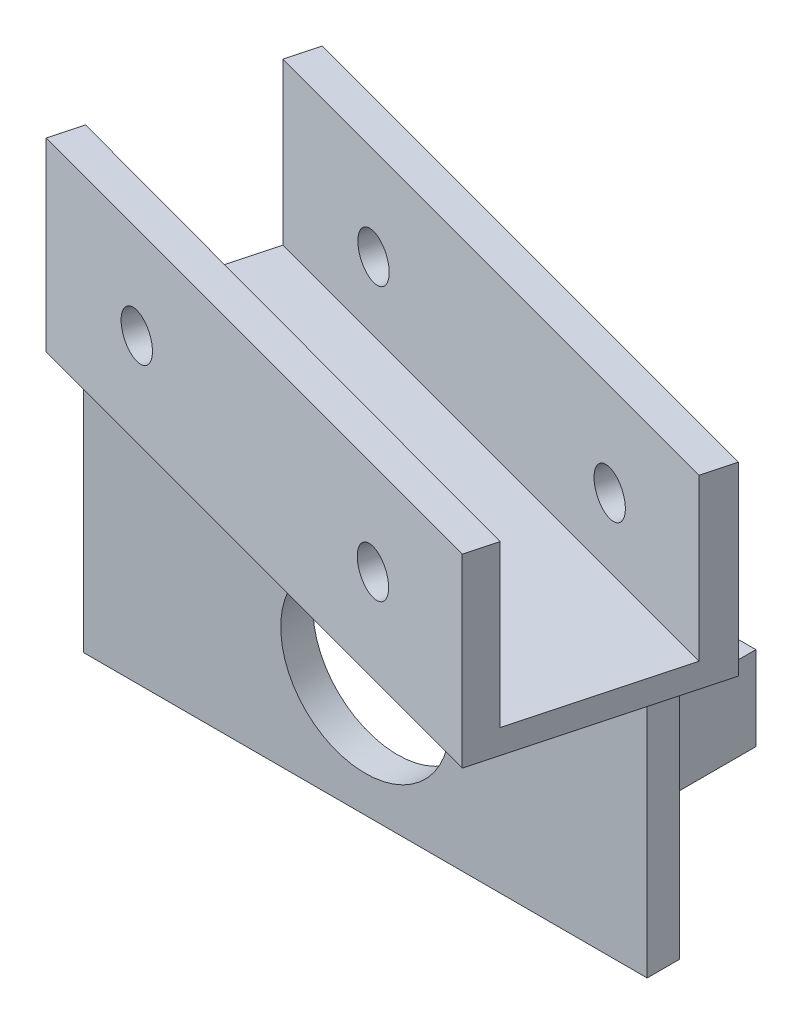
ISO-10303-21;
HEADER;
FILE_DESCRIPTION(('STEP AP214'),'2;1');
FILE_NAME('part.step','',(''),(''),'','','');
FILE_SCHEMA(('AUTOMOTIVE_DESIGN { 1 0 10303 214 1 1 1 1 }'));
ENDSEC;
DATA;
#1=APPLICATION_CONTEXT('core data for automotive mechanical design processes');
#2=APPLICATION_PROTOCOL_DEFINITION('international standard','automotive_design',2000,#1);
#3=PRODUCT_CONTEXT('',#1,'mechanical');
#4=PRODUCT('Part','Part','',(#3));
#5=PRODUCT_RELATED_PRODUCT_CATEGORY('part','',(#4));
#6=PRODUCT_DEFINITION_FORMATION('','',#4);
#7=PRODUCT_DEFINITION_CONTEXT('part definition',#1,'design');
#8=PRODUCT_DEFINITION('design','',#6,#7);
#9=PRODUCT_DEFINITION_SHAPE('','',#8);
#10=(LENGTH_UNIT() NAMED_UNIT(*) SI_UNIT(.MILLI.,.METRE.));
#11=(NAMED_UNIT(*) PLANE_ANGLE_UNIT() SI_UNIT($,.RADIAN.));
#12=(NAMED_UNIT(*) SI_UNIT($,.STERADIAN.) SOLID_ANGLE_UNIT());
#13=UNCERTAINTY_MEASURE_WITH_UNIT(LENGTH_MEASURE(1.E-05),#10,'distance_accuracy_value','');
#14=(GEOMETRIC_REPRESENTATION_CONTEXT(3) GLOBAL_UNCERTAINTY_ASSIGNED_CONTEXT((#13)) GLOBAL_UNIT_ASSIGNED_CONTEXT((#10,
#11,#12)) REPRESENTATION_CONTEXT('',''));
#15=CARTESIAN_POINT('',(0.,0.,0.));
#16=DIRECTION('',(0.,0.,1.));
#17=DIRECTION('',(1.,0.,0.));
#18=AXIS2_PLACEMENT_3D('',#15,#16,#17);
#19=CARTESIAN_POINT('',(0.,0.,0.));
#20=DIRECTION('',(0.,0.,1.));
#21=DIRECTION('',(1.,0.,0.));
#22=AXIS2_PLACEMENT_3D('',#19,#20,#21);
#23=PLANE('',#22);
#24=DIRECTION('',(0.,-1.,0.));
#25=VECTOR('',#24,1.);
#26=CARTESIAN_POINT('',(62.5000000000001,-8.93838300419958,0.));
#27=LINE('',#26,#25);
#28=CARTESIAN_POINT('',(62.5000000000001,-8.93838300419958,0.));
#29=VERTEX_POINT('',#28);
#30=CARTESIAN_POINT('',(62.5000000000001,-19.3737653444259,0.));
#31=VERTEX_POINT('',#30);
#32=EDGE_CURVE('E284',#29,#31,#27,.T.);
#33=ORIENTED_EDGE('',*,*,#32,.F.);
#34=DIRECTION('',(1.,0.,0.));
#35=VECTOR('',#34,1.);
#36=CARTESIAN_POINT('',(62.5000000000001,-8.93838300419958,0.));
#37=LINE('',#36,#35);
#38=CARTESIAN_POINT('',(54.3490123333825,-8.93838300419958,0.));
#39=VERTEX_POINT('',#38);
#40=EDGE_CURVE('E314',#39,#29,#37,.T.);
#41=ORIENTED_EDGE('',*,*,#40,.F.);
#42=DIRECTION('',(0.,1.,0.));
#43=VECTOR('',#42,1.);
#44=CARTESIAN_POINT('',(54.3490123333825,-8.93838300419958,0.));
#45=LINE('',#44,#43);
#46=CARTESIAN_POINT('',(54.3490123333825,-19.3737653444259,0.));
#47=VERTEX_POINT('',#46);
#48=EDGE_CURVE('E319',#47,#39,#45,.T.);
#49=ORIENTED_EDGE('',*,*,#48,.F.);
#50=DIRECTION('',(-1.,0.,0.));
#51=VECTOR('',#50,1.);
#52=CARTESIAN_POINT('',(54.3490123333825,-19.3737653444259,0.));
#53=LINE('',#52,#51);
#54=EDGE_CURVE('E325',#31,#47,#53,.T.);
#55=ORIENTED_EDGE('',*,*,#54,.F.);
#56=EDGE_LOOP('',(#33,#41,#49,#55));
#57=FACE_BOUND('',#56,.T.);
#58=DIRECTION('',(0.,-1.,0.));
#59=VECTOR('',#58,1.);
#60=CARTESIAN_POINT('',(0.,0.,0.));
#61=LINE('',#60,#59);
#62=CARTESIAN_POINT('',(0.,0.,0.));
#63=VERTEX_POINT('',#62);
#64=CARTESIAN_POINT('',(0.,-30.,0.));
#65=VERTEX_POINT('',#64);
#66=EDGE_CURVE('E340',#63,#65,#61,.T.);
#67=ORIENTED_EDGE('',*,*,#66,.F.);
#68=DIRECTION('',(-1.,0.,0.));
#69=VECTOR('',#68,1.);
#70=CARTESIAN_POINT('',(0.,0.,0.));
#71=LINE('',#70,#69);
#72=CARTESIAN_POINT('',(70.,0.,0.));
#73=VERTEX_POINT('',#72);
#74=EDGE_CURVE('E341',#73,#63,#71,.T.);
#75=ORIENTED_EDGE('',*,*,#74,.F.);
#76=DIRECTION('',(0.,1.,0.));
#77=VECTOR('',#76,1.);
#78=CARTESIAN_POINT('',(70.,0.,0.));
#79=LINE('',#78,#77);
#80=CARTESIAN_POINT('',(70.,-30.,0.));
#81=VERTEX_POINT('',#80);
#82=EDGE_CURVE('E354',#81,#73,#79,.T.);
#83=ORIENTED_EDGE('',*,*,#82,.F.);
#84=DIRECTION('',(1.,0.,0.));
#85=VECTOR('',#84,1.);
#86=CARTESIAN_POINT('',(0.,-30.,0.));
#87=LINE('',#86,#85);
#88=EDGE_CURVE('E352',#65,#81,#87,.T.);
#89=ORIENTED_EDGE('',*,*,#88,.F.);
#90=EDGE_LOOP('',(#67,#75,#83,#89));
#91=FACE_BOUND('',#90,.T.);
#92=CARTESIAN_POINT('',(35.,-15.,0.));
#93=DIRECTION('',(0.,0.,1.));
#94=DIRECTION('',(1.,0.,0.));
#95=AXIS2_PLACEMENT_3D('',#92,#93,#94);
#96=CIRCLE('',#95,10.5);
#97=CARTESIAN_POINT('',(45.5,-15.,0.));
#98=VERTEX_POINT('',#97);
#99=EDGE_CURVE('E305',#98,#98,#96,.T.);
#100=ORIENTED_EDGE('',*,*,#99,.T.);
#101=EDGE_LOOP('',(#100));
#102=FACE_BOUND('',#101,.T.);
#103=DIRECTION('',(0.,1.,0.));
#104=VECTOR('',#103,1.);
#105=CARTESIAN_POINT('',(7.50000000000006,-25.,0.));
#106=LINE('',#105,#104);
#107=CARTESIAN_POINT('',(7.50000000000006,-25.,0.));
#108=VERTEX_POINT('',#107);
#109=CARTESIAN_POINT('',(7.50000000000006,-5.00000000000002,0.));
#110=VERTEX_POINT('',#109);
#111=EDGE_CURVE('E276',#108,#110,#106,.T.);
#112=ORIENTED_EDGE('',*,*,#111,.F.);
#113=DIRECTION('',(-1.,0.,0.));
#114=VECTOR('',#113,1.);
#115=CARTESIAN_POINT('',(14.3209161154327,-25.,0.));
#116=LINE('',#115,#114);
#117=CARTESIAN_POINT('',(14.3209161154327,-25.,0.));
#118=VERTEX_POINT('',#117);
#119=EDGE_CURVE('E275',#118,#108,#116,.T.);
#120=ORIENTED_EDGE('',*,*,#119,.F.);
#121=DIRECTION('',(0.,-1.,0.));
#122=VECTOR('',#121,1.);
#123=CARTESIAN_POINT('',(14.3209161154327,-5.00000000000002,0.));
#124=LINE('',#123,#122);
#125=CARTESIAN_POINT('',(14.3209161154327,-5.00000000000002,0.));
#126=VERTEX_POINT('',#125);
#127=EDGE_CURVE('E286',#126,#118,#124,.T.);
#128=ORIENTED_EDGE('',*,*,#127,.F.);
#129=DIRECTION('',(1.,0.,0.));
#130=VECTOR('',#129,1.);
#131=CARTESIAN_POINT('',(7.50000000000006,-5.00000000000002,0.));
#132=LINE('',#131,#130);
#133=EDGE_CURVE('E282',#110,#126,#132,.T.);
#134=ORIENTED_EDGE('',*,*,#133,.F.);
#135=EDGE_LOOP('',(#112,#120,#128,#134));
#136=FACE_BOUND('',#135,.T.);
#137=ADVANCED_FACE('F39',(#57,#91,#102,#136),#23,.F.);
#138=CARTESIAN_POINT('',(0.,0.,4.));
#139=DIRECTION('',(0.,0.,1.));
#140=DIRECTION('',(1.,0.,0.));
#141=AXIS2_PLACEMENT_3D('',#138,#139,#140);
#142=PLANE('',#141);
#143=DIRECTION('',(0.,-1.,0.));
#144=VECTOR('',#143,1.);
#145=CARTESIAN_POINT('',(0.,0.,4.));
#146=LINE('',#145,#144);
#147=CARTESIAN_POINT('',(0.,0.,4.));
#148=VERTEX_POINT('',#147);
#149=CARTESIAN_POINT('',(0.,-30.,4.));
#150=VERTEX_POINT('',#149);
#151=EDGE_CURVE('E338',#148,#150,#146,.T.);
#152=ORIENTED_EDGE('',*,*,#151,.T.);
#153=DIRECTION('',(1.,0.,0.));
#154=VECTOR('',#153,1.);
#155=CARTESIAN_POINT('',(0.,-30.,4.));
#156=LINE('',#155,#154);
#157=CARTESIAN_POINT('',(70.,-30.,4.));
#158=VERTEX_POINT('',#157);
#159=EDGE_CURVE('E344',#150,#158,#156,.T.);
#160=ORIENTED_EDGE('',*,*,#159,.T.);
#161=DIRECTION('',(0.,1.,0.));
#162=VECTOR('',#161,1.);
#163=CARTESIAN_POINT('',(70.,0.,4.));
#164=LINE('',#163,#162);
#165=CARTESIAN_POINT('',(70.,0.,4.));
#166=VERTEX_POINT('',#165);
#167=EDGE_CURVE('E346',#158,#166,#164,.T.);
#168=ORIENTED_EDGE('',*,*,#167,.T.);
#169=DIRECTION('',(-1.,0.,0.));
#170=VECTOR('',#169,1.);
#171=CARTESIAN_POINT('',(0.,0.,4.));
#172=LINE('',#171,#170);
#173=EDGE_CURVE('E349',#166,#148,#172,.T.);
#174=ORIENTED_EDGE('',*,*,#173,.T.);
#175=EDGE_LOOP('',(#152,#160,#168,#174));
#176=FACE_BOUND('',#175,.T.);
#177=CARTESIAN_POINT('',(35.,-15.,4.));
#178=DIRECTION('',(0.,0.,1.));
#179=DIRECTION('',(1.,0.,0.));
#180=AXIS2_PLACEMENT_3D('',#177,#178,#179);
#181=CIRCLE('',#180,10.5);
#182=CARTESIAN_POINT('',(45.5,-15.,4.));
#183=VERTEX_POINT('',#182);
#184=EDGE_CURVE('E333',#183,#183,#181,.T.);
#185=ORIENTED_EDGE('',*,*,#184,.F.);
#186=EDGE_LOOP('',(#185));
#187=FACE_BOUND('',#186,.T.);
#188=ADVANCED_FACE('F418',(#176,#187),#142,.T.);
#189=CARTESIAN_POINT('',(0.,0.,4.));
#190=DIRECTION('',(1.,0.,0.));
#191=DIRECTION('',(0.,1.,0.));
#192=AXIS2_PLACEMENT_3D('',#189,#190,#191);
#193=PLANE('',#192);
#194=ORIENTED_EDGE('',*,*,#66,.T.);
#195=DIRECTION('',(0.,0.,-1.));
#196=VECTOR('',#195,1.);
#197=CARTESIAN_POINT('',(0.,-30.,4.));
#198=LINE('',#197,#196);
#199=EDGE_CURVE('E11',#150,#65,#198,.T.);
#200=ORIENTED_EDGE('',*,*,#199,.F.);
#201=ORIENTED_EDGE('',*,*,#151,.F.);
#202=DIRECTION('',(0.,0.,-1.));
#203=VECTOR('',#202,1.);
#204=CARTESIAN_POINT('',(0.,0.,4.));
#205=LINE('',#204,#203);
#206=EDGE_CURVE('E350',#148,#63,#205,.T.);
#207=ORIENTED_EDGE('',*,*,#206,.T.);
#208=EDGE_LOOP('',(#194,#200,#201,#207));
#209=FACE_BOUND('',#208,.T.);
#210=ADVANCED_FACE('F41',(#209),#193,.F.);
#211=CARTESIAN_POINT('',(0.,-30.,4.));
#212=DIRECTION('',(0.,1.,0.));
#213=DIRECTION('',(0.,0.,1.));
#214=AXIS2_PLACEMENT_3D('',#211,#212,#213);
#215=PLANE('',#214);
#216=ORIENTED_EDGE('',*,*,#88,.T.);
#217=DIRECTION('',(0.,0.,-1.));
#218=VECTOR('',#217,1.);
#219=CARTESIAN_POINT('',(70.,-30.,4.));
#220=LINE('',#219,#218);
#221=EDGE_CURVE('E48',#158,#81,#220,.T.);
#222=ORIENTED_EDGE('',*,*,#221,.F.);
#223=ORIENTED_EDGE('',*,*,#159,.F.);
#224=ORIENTED_EDGE('',*,*,#199,.T.);
#225=EDGE_LOOP('',(#216,#222,#223,#224));
#226=FACE_BOUND('',#225,.T.);
#227=ADVANCED_FACE('F432',(#226),#215,.F.);
#228=CARTESIAN_POINT('',(70.,0.,4.));
#229=DIRECTION('',(-1.,0.,0.));
#230=DIRECTION('',(0.,0.,1.));
#231=AXIS2_PLACEMENT_3D('',#228,#229,#230);
#232=PLANE('',#231);
#233=ORIENTED_EDGE('',*,*,#82,.T.);
#234=DIRECTION('',(0.,0.,-1.));
#235=VECTOR('',#234,1.);
#236=CARTESIAN_POINT('',(70.,0.,4.));
#237=LINE('',#236,#235);
#238=EDGE_CURVE('E363',#166,#73,#237,.T.);
#239=ORIENTED_EDGE('',*,*,#238,.F.);
#240=ORIENTED_EDGE('',*,*,#167,.F.);
#241=ORIENTED_EDGE('',*,*,#221,.T.);
#242=EDGE_LOOP('',(#233,#239,#240,#241));
#243=FACE_BOUND('',#242,.T.);
#244=ADVANCED_FACE('F431',(#243),#232,.F.);
#245=CARTESIAN_POINT('',(35.,-15.,4.));
#246=DIRECTION('',(0.,0.,-1.));
#247=DIRECTION('',(-1.,0.,0.));
#248=AXIS2_PLACEMENT_3D('',#245,#246,#247);
#249=CYLINDRICAL_SURFACE('',#248,10.5);
#250=ORIENTED_EDGE('',*,*,#184,.T.);
#251=EDGE_LOOP('',(#250));
#252=FACE_BOUND('',#251,.T.);
#253=ORIENTED_EDGE('',*,*,#99,.F.);
#254=EDGE_LOOP('',(#253));
#255=FACE_BOUND('',#254,.T.);
#256=ADVANCED_FACE('F433',(#252,#255),#249,.F.);
#257=CARTESIAN_POINT('',(62.5000000000001,-8.93838300419958,-17.));
#258=DIRECTION('',(-1.,0.,0.));
#259=DIRECTION('',(0.,0.,1.));
#260=AXIS2_PLACEMENT_3D('',#257,#258,#259);
#261=PLANE('',#260);
#262=ORIENTED_EDGE('',*,*,#32,.T.);
#263=DIRECTION('',(0.,0.,1.));
#264=VECTOR('',#263,1.);
#265=CARTESIAN_POINT('',(62.5000000000001,-19.3737653444259,-17.));
#266=LINE('',#265,#264);
#267=CARTESIAN_POINT('',(62.5000000000001,-19.3737653444259,-17.));
#268=VERTEX_POINT('',#267);
#269=EDGE_CURVE('E254',#268,#31,#266,.T.);
#270=ORIENTED_EDGE('',*,*,#269,.F.);
#271=DIRECTION('',(0.,-1.,0.));
#272=VECTOR('',#271,1.);
#273=CARTESIAN_POINT('',(62.5000000000001,-8.93838300419958,-17.));
#274=LINE('',#273,#272);
#275=CARTESIAN_POINT('',(62.5000000000001,-8.93838300419958,-17.));
#276=VERTEX_POINT('',#275);
#277=EDGE_CURVE('E316',#276,#268,#274,.T.);
#278=ORIENTED_EDGE('',*,*,#277,.F.);
#279=DIRECTION('',(0.,0.,1.));
#280=VECTOR('',#279,1.);
#281=CARTESIAN_POINT('',(62.5000000000001,-8.93838300419958,-17.));
#282=LINE('',#281,#280);
#283=EDGE_CURVE('E311',#276,#29,#282,.T.);
#284=ORIENTED_EDGE('',*,*,#283,.T.);
#285=EDGE_LOOP('',(#262,#270,#278,#284));
#286=FACE_BOUND('',#285,.T.);
#287=ADVANCED_FACE('F458',(#286),#261,.F.);
#288=CARTESIAN_POINT('',(54.3490123333825,-19.3737653444259,-17.));
#289=DIRECTION('',(0.,1.,0.));
#290=DIRECTION('',(0.,0.,1.));
#291=AXIS2_PLACEMENT_3D('',#288,#289,#290);
#292=PLANE('',#291);
#293=ORIENTED_EDGE('',*,*,#54,.T.);
#294=DIRECTION('',(0.,0.,1.));
#295=VECTOR('',#294,1.);
#296=CARTESIAN_POINT('',(54.3490123333825,-19.3737653444259,-17.));
#297=LINE('',#296,#295);
#298=CARTESIAN_POINT('',(54.3490123333825,-19.3737653444259,-17.));
#299=VERTEX_POINT('',#298);
#300=EDGE_CURVE('E304',#299,#47,#297,.T.);
#301=ORIENTED_EDGE('',*,*,#300,.F.);
#302=DIRECTION('',(-1.,0.,0.));
#303=VECTOR('',#302,1.);
#304=CARTESIAN_POINT('',(54.3490123333825,-19.3737653444259,-17.));
#305=LINE('',#304,#303);
#306=EDGE_CURVE('E330',#268,#299,#305,.T.);
#307=ORIENTED_EDGE('',*,*,#306,.F.);
#308=ORIENTED_EDGE('',*,*,#269,.T.);
#309=EDGE_LOOP('',(#293,#301,#307,#308));
#310=FACE_BOUND('',#309,.T.);
#311=ADVANCED_FACE('F495',(#310),#292,.F.);
#312=CARTESIAN_POINT('',(54.3490123333825,-8.93838300419958,-17.));
#313=DIRECTION('',(1.,0.,0.));
#314=DIRECTION('',(0.,0.,-1.));
#315=AXIS2_PLACEMENT_3D('',#312,#313,#314);
#316=PLANE('',#315);
#317=ORIENTED_EDGE('',*,*,#48,.T.);
#318=DIRECTION('',(0.,0.,1.));
#319=VECTOR('',#318,1.);
#320=CARTESIAN_POINT('',(54.3490123333825,-8.93838300419958,-17.));
#321=LINE('',#320,#319);
#322=CARTESIAN_POINT('',(54.3490123333825,-8.93838300419958,-17.));
#323=VERTEX_POINT('',#322);
#324=EDGE_CURVE('E308',#323,#39,#321,.T.);
#325=ORIENTED_EDGE('',*,*,#324,.F.);
#326=DIRECTION('',(0.,1.,0.));
#327=VECTOR('',#326,1.);
#328=CARTESIAN_POINT('',(54.3490123333825,-8.93838300419958,-17.));
#329=LINE('',#328,#327);
#330=EDGE_CURVE('E329',#299,#323,#329,.T.);
#331=ORIENTED_EDGE('',*,*,#330,.F.);
#332=ORIENTED_EDGE('',*,*,#300,.T.);
#333=EDGE_LOOP('',(#317,#325,#331,#332));
#334=FACE_BOUND('',#333,.T.);
#335=ADVANCED_FACE('F496',(#334),#316,.F.);
#336=CARTESIAN_POINT('',(62.5000000000001,-8.93838300419958,-17.));
#337=DIRECTION('',(0.,-1.,0.));
#338=DIRECTION('',(0.,0.,-1.));
#339=AXIS2_PLACEMENT_3D('',#336,#337,#338);
#340=PLANE('',#339);
#341=ORIENTED_EDGE('',*,*,#40,.T.);
#342=ORIENTED_EDGE('',*,*,#283,.F.);
#343=DIRECTION('',(1.,0.,0.));
#344=VECTOR('',#343,1.);
#345=CARTESIAN_POINT('',(62.5000000000001,-8.93838300419958,-17.));
#346=LINE('',#345,#344);
#347=EDGE_CURVE('E313',#323,#276,#346,.T.);
#348=ORIENTED_EDGE('',*,*,#347,.F.);
#349=ORIENTED_EDGE('',*,*,#324,.T.);
#350=EDGE_LOOP('',(#341,#342,#348,#349));
#351=FACE_BOUND('',#350,.T.);
#352=ADVANCED_FACE('F499',(#351),#340,.F.);
#353=CARTESIAN_POINT('',(0.,0.,-17.));
#354=DIRECTION('',(0.,0.,1.));
#355=DIRECTION('',(1.,0.,0.));
#356=AXIS2_PLACEMENT_3D('',#353,#354,#355);
#357=PLANE('',#356);
#358=CARTESIAN_POINT('',(58.5000000000001,-14.2890995260664,-17.));
#359=DIRECTION('',(0.,0.,-1.));
#360=DIRECTION('',(-1.,0.,0.));
#361=AXIS2_PLACEMENT_3D('',#358,#359,#360);
#362=CIRCLE('',#361,0.999999999999998);
#363=CARTESIAN_POINT('',(57.5000000000001,-14.2890995260664,-17.));
#364=VERTEX_POINT('',#363);
#365=EDGE_CURVE('E251',#364,#364,#362,.T.);
#366=ORIENTED_EDGE('',*,*,#365,.F.);
#367=EDGE_LOOP('',(#366));
#368=FACE_BOUND('',#367,.T.);
#369=ORIENTED_EDGE('',*,*,#277,.T.);
#370=ORIENTED_EDGE('',*,*,#306,.T.);
#371=ORIENTED_EDGE('',*,*,#330,.T.);
#372=ORIENTED_EDGE('',*,*,#347,.T.);
#373=EDGE_LOOP('',(#369,#370,#371,#372));
#374=FACE_BOUND('',#373,.T.);
#375=ADVANCED_FACE('F488',(#368,#374),#357,.F.);
#376=CARTESIAN_POINT('',(7.50000000000006,-25.,-17.));
#377=DIRECTION('',(1.,0.,0.));
#378=DIRECTION('',(0.,0.,-1.));
#379=AXIS2_PLACEMENT_3D('',#376,#377,#378);
#380=PLANE('',#379);
#381=ORIENTED_EDGE('',*,*,#111,.T.);
#382=DIRECTION('',(0.,0.,1.));
#383=VECTOR('',#382,1.);
#384=CARTESIAN_POINT('',(7.50000000000006,-5.00000000000002,-17.));
#385=LINE('',#384,#383);
#386=CARTESIAN_POINT('',(7.50000000000006,-5.00000000000002,-17.));
#387=VERTEX_POINT('',#386);
#388=EDGE_CURVE('E299',#387,#110,#385,.T.);
#389=ORIENTED_EDGE('',*,*,#388,.F.);
#390=DIRECTION('',(0.,1.,0.));
#391=VECTOR('',#390,1.);
#392=CARTESIAN_POINT('',(7.50000000000006,-25.,-17.));
#393=LINE('',#392,#391);
#394=CARTESIAN_POINT('',(7.50000000000006,-25.,-17.));
#395=VERTEX_POINT('',#394);
#396=EDGE_CURVE('E267',#395,#387,#393,.T.);
#397=ORIENTED_EDGE('',*,*,#396,.F.);
#398=DIRECTION('',(0.,0.,1.));
#399=VECTOR('',#398,1.);
#400=CARTESIAN_POINT('',(7.50000000000006,-25.,-17.));
#401=LINE('',#400,#399);
#402=EDGE_CURVE('E279',#395,#108,#401,.T.);
#403=ORIENTED_EDGE('',*,*,#402,.T.);
#404=EDGE_LOOP('',(#381,#389,#397,#403));
#405=FACE_BOUND('',#404,.T.);
#406=ADVANCED_FACE('F468',(#405),#380,.F.);
#407=CARTESIAN_POINT('',(7.50000000000006,-5.00000000000002,-17.));
#408=DIRECTION('',(0.,-1.,0.));
#409=DIRECTION('',(0.,0.,-1.));
#410=AXIS2_PLACEMENT_3D('',#407,#408,#409);
#411=PLANE('',#410);
#412=ORIENTED_EDGE('',*,*,#133,.T.);
#413=DIRECTION('',(0.,0.,1.));
#414=VECTOR('',#413,1.);
#415=CARTESIAN_POINT('',(14.3209161154327,-5.00000000000002,-17.));
#416=LINE('',#415,#414);
#417=CARTESIAN_POINT('',(14.3209161154327,-5.00000000000002,-17.));
#418=VERTEX_POINT('',#417);
#419=EDGE_CURVE('E298',#418,#126,#416,.T.);
#420=ORIENTED_EDGE('',*,*,#419,.F.);
#421=DIRECTION('',(1.,0.,0.));
#422=VECTOR('',#421,1.);
#423=CARTESIAN_POINT('',(7.50000000000006,-5.00000000000002,-17.));
#424=LINE('',#423,#422);
#425=EDGE_CURVE('E272',#387,#418,#424,.T.);
#426=ORIENTED_EDGE('',*,*,#425,.F.);
#427=ORIENTED_EDGE('',*,*,#388,.T.);
#428=EDGE_LOOP('',(#412,#420,#426,#427));
#429=FACE_BOUND('',#428,.T.);
#430=ADVANCED_FACE('F479',(#429),#411,.F.);
#431=CARTESIAN_POINT('',(14.3209161154327,-5.00000000000002,-17.));
#432=DIRECTION('',(-1.,0.,0.));
#433=DIRECTION('',(0.,-1.,0.));
#434=AXIS2_PLACEMENT_3D('',#431,#432,#433);
#435=PLANE('',#434);
#436=ORIENTED_EDGE('',*,*,#127,.T.);
#437=DIRECTION('',(0.,0.,1.));
#438=VECTOR('',#437,1.);
#439=CARTESIAN_POINT('',(14.3209161154327,-25.,-17.));
#440=LINE('',#439,#438);
#441=CARTESIAN_POINT('',(14.3209161154327,-25.,-17.));
#442=VERTEX_POINT('',#441);
#443=EDGE_CURVE('E291',#442,#118,#440,.T.);
#444=ORIENTED_EDGE('',*,*,#443,.F.);
#445=DIRECTION('',(0.,-1.,0.));
#446=VECTOR('',#445,1.);
#447=CARTESIAN_POINT('',(14.3209161154327,-5.00000000000002,-17.));
#448=LINE('',#447,#446);
#449=EDGE_CURVE('E274',#418,#442,#448,.T.);
#450=ORIENTED_EDGE('',*,*,#449,.F.);
#451=ORIENTED_EDGE('',*,*,#419,.T.);
#452=EDGE_LOOP('',(#436,#444,#450,#451));
#453=FACE_BOUND('',#452,.T.);
#454=ADVANCED_FACE('F476',(#453),#435,.F.);
#455=CARTESIAN_POINT('',(14.3209161154327,-25.,-17.));
#456=DIRECTION('',(0.,1.,0.));
#457=DIRECTION('',(0.,0.,1.));
#458=AXIS2_PLACEMENT_3D('',#455,#456,#457);
#459=PLANE('',#458);
#460=ORIENTED_EDGE('',*,*,#119,.T.);
#461=ORIENTED_EDGE('',*,*,#402,.F.);
#462=DIRECTION('',(-1.,0.,0.));
#463=VECTOR('',#462,1.);
#464=CARTESIAN_POINT('',(14.3209161154327,-25.,-17.));
#465=LINE('',#464,#463);
#466=EDGE_CURVE('E277',#442,#395,#465,.T.);
#467=ORIENTED_EDGE('',*,*,#466,.F.);
#468=ORIENTED_EDGE('',*,*,#443,.T.);
#469=EDGE_LOOP('',(#460,#461,#467,#468));
#470=FACE_BOUND('',#469,.T.);
#471=ADVANCED_FACE('F467',(#470),#459,.F.);
#472=CARTESIAN_POINT('',(0.,0.,-17.));
#473=DIRECTION('',(0.,0.,-1.));
#474=DIRECTION('',(-1.,0.,0.));
#475=AXIS2_PLACEMENT_3D('',#472,#473,#474);
#476=PLANE('',#475);
#477=CARTESIAN_POINT('',(11.5000000000001,-7.00000000000002,-17.));
#478=DIRECTION('',(0.,0.,-1.));
#479=DIRECTION('',(-1.,0.,0.));
#480=AXIS2_PLACEMENT_3D('',#477,#478,#479);
#481=CIRCLE('',#480,1.);
#482=CARTESIAN_POINT('',(10.5000000000001,-7.00000000000002,-17.));
#483=VERTEX_POINT('',#482);
#484=EDGE_CURVE('E260',#483,#483,#481,.T.);
#485=ORIENTED_EDGE('',*,*,#484,.F.);
#486=EDGE_LOOP('',(#485));
#487=FACE_BOUND('',#486,.T.);
#488=CARTESIAN_POINT('',(11.5000000000001,-23.,-17.));
#489=DIRECTION('',(0.,0.,-1.));
#490=DIRECTION('',(-1.,0.,0.));
#491=AXIS2_PLACEMENT_3D('',#488,#489,#490);
#492=CIRCLE('',#491,1.);
#493=CARTESIAN_POINT('',(10.5000000000001,-23.,-17.));
#494=VERTEX_POINT('',#493);
#495=EDGE_CURVE('E264',#494,#494,#492,.T.);
#496=ORIENTED_EDGE('',*,*,#495,.F.);
#497=EDGE_LOOP('',(#496));
#498=FACE_BOUND('',#497,.T.);
#499=ORIENTED_EDGE('',*,*,#396,.T.);
#500=ORIENTED_EDGE('',*,*,#425,.T.);
#501=ORIENTED_EDGE('',*,*,#449,.T.);
#502=ORIENTED_EDGE('',*,*,#466,.T.);
#503=EDGE_LOOP('',(#499,#500,#501,#502));
#504=FACE_BOUND('',#503,.T.);
#505=ADVANCED_FACE('F475',(#487,#498,#504),#476,.T.);
#506=CARTESIAN_POINT('',(11.5000000000001,-23.,0.));
#507=DIRECTION('',(0.,0.,-1.));
#508=DIRECTION('',(-1.,0.,0.));
#509=AXIS2_PLACEMENT_3D('',#506,#507,#508);
#510=CYLINDRICAL_SURFACE('',#509,1.);
#511=CARTESIAN_POINT('',(11.5000000000001,-23.,0.));
#512=DIRECTION('',(0.,0.,-1.));
#513=DIRECTION('',(-1.,0.,0.));
#514=AXIS2_PLACEMENT_3D('',#511,#512,#513);
#515=CIRCLE('',#514,1.);
#516=CARTESIAN_POINT('',(10.5000000000001,-23.,0.));
#517=VERTEX_POINT('',#516);
#518=EDGE_CURVE('E189',#517,#517,#515,.T.);
#519=ORIENTED_EDGE('',*,*,#518,.F.);
#520=EDGE_LOOP('',(#519));
#521=FACE_BOUND('',#520,.T.);
#522=ORIENTED_EDGE('',*,*,#495,.T.);
#523=EDGE_LOOP('',(#522));
#524=FACE_BOUND('',#523,.T.);
#525=ADVANCED_FACE('F542',(#521,#524),#510,.F.);
#526=CARTESIAN_POINT('',(11.5000000000001,-23.,0.));
#527=DIRECTION('',(0.,0.,-1.));
#528=DIRECTION('',(-1.,0.,0.));
#529=AXIS2_PLACEMENT_3D('',#526,#527,#528);
#530=PLANE('',#529);
#531=ORIENTED_EDGE('',*,*,#518,.T.);
#532=EDGE_LOOP('',(#531));
#533=FACE_BOUND('',#532,.T.);
#534=ADVANCED_FACE('F536',(#533),#530,.T.);
#535=CARTESIAN_POINT('',(11.5000000000001,-7.00000000000002,0.));
#536=DIRECTION('',(0.,0.,-1.));
#537=DIRECTION('',(-1.,0.,0.));
#538=AXIS2_PLACEMENT_3D('',#535,#536,#537);
#539=CYLINDRICAL_SURFACE('',#538,1.);
#540=CARTESIAN_POINT('',(11.5000000000001,-7.00000000000002,0.));
#541=DIRECTION('',(0.,0.,-1.));
#542=DIRECTION('',(-1.,0.,0.));
#543=AXIS2_PLACEMENT_3D('',#540,#541,#542);
#544=CIRCLE('',#543,1.);
#545=CARTESIAN_POINT('',(10.5000000000001,-7.00000000000002,0.));
#546=VERTEX_POINT('',#545);
#547=EDGE_CURVE('E258',#546,#546,#544,.T.);
#548=ORIENTED_EDGE('',*,*,#547,.F.);
#549=EDGE_LOOP('',(#548));
#550=FACE_BOUND('',#549,.T.);
#551=ORIENTED_EDGE('',*,*,#484,.T.);
#552=EDGE_LOOP('',(#551));
#553=FACE_BOUND('',#552,.T.);
#554=ADVANCED_FACE('F535',(#550,#553),#539,.F.);
#555=CARTESIAN_POINT('',(11.5000000000001,-7.00000000000002,0.));
#556=DIRECTION('',(0.,0.,-1.));
#557=DIRECTION('',(-1.,0.,0.));
#558=AXIS2_PLACEMENT_3D('',#555,#556,#557);
#559=PLANE('',#558);
#560=ORIENTED_EDGE('',*,*,#547,.T.);
#561=EDGE_LOOP('',(#560));
#562=FACE_BOUND('',#561,.T.);
#563=ADVANCED_FACE('F523',(#562),#559,.T.);
#564=CARTESIAN_POINT('',(58.5000000000001,-14.2890995260664,0.));
#565=DIRECTION('',(0.,0.,-1.));
#566=DIRECTION('',(-1.,0.,0.));
#567=AXIS2_PLACEMENT_3D('',#564,#565,#566);
#568=CYLINDRICAL_SURFACE('',#567,0.999999999999998);
#569=CARTESIAN_POINT('',(58.5000000000001,-14.2890995260664,0.));
#570=DIRECTION('',(0.,0.,-1.));
#571=DIRECTION('',(-1.,0.,0.));
#572=AXIS2_PLACEMENT_3D('',#569,#570,#571);
#573=CIRCLE('',#572,0.999999999999998);
#574=CARTESIAN_POINT('',(57.5000000000001,-14.2890995260664,0.));
#575=VERTEX_POINT('',#574);
#576=EDGE_CURVE('E249',#575,#575,#573,.T.);
#577=ORIENTED_EDGE('',*,*,#576,.F.);
#578=EDGE_LOOP('',(#577));
#579=FACE_BOUND('',#578,.T.);
#580=ORIENTED_EDGE('',*,*,#365,.T.);
#581=EDGE_LOOP('',(#580));
#582=FACE_BOUND('',#581,.T.);
#583=ADVANCED_FACE('F521',(#579,#582),#568,.F.);
#584=CARTESIAN_POINT('',(58.5000000000001,-14.2890995260664,0.));
#585=DIRECTION('',(0.,0.,-1.));
#586=DIRECTION('',(-1.,0.,0.));
#587=AXIS2_PLACEMENT_3D('',#584,#585,#586);
#588=PLANE('',#587);
#589=ORIENTED_EDGE('',*,*,#576,.T.);
#590=EDGE_LOOP('',(#589));
#591=FACE_BOUND('',#590,.T.);
#592=ADVANCED_FACE('F524',(#591),#588,.T.);
#593=CARTESIAN_POINT('',(0.,0.,0.));
#594=DIRECTION('',(0.,1.,0.));
#595=DIRECTION('',(0.,0.,1.));
#596=AXIS2_PLACEMENT_3D('',#593,#594,#595);
#597=PLANE('',#596);
#598=DIRECTION('',(-0.258819045102515,0.,0.96592582628907));
#599=VECTOR('',#598,1.);
#600=CARTESIAN_POINT('',(-4.63036875734262,0.,4.));
#601=LINE('',#600,#599);
#602=CARTESIAN_POINT('',(2.61656450552779,0.,-23.0459231360939));
#603=VERTEX_POINT('',#602);
#604=CARTESIAN_POINT('',(-4.63036875734262,0.,4.));
#605=VERTEX_POINT('',#604);
#606=EDGE_CURVE('E187',#603,#605,#601,.T.);
#607=ORIENTED_EDGE('',*,*,#606,.F.);
#608=DIRECTION('',(-0.96592582628907,0.,-0.258819045102514));
#609=VECTOR('',#608,1.);
#610=CARTESIAN_POINT('',(73.1977220456754,0.,-4.13375897235806));
#611=LINE('',#610,#609);
#612=CARTESIAN_POINT('',(73.1977220456754,0.,-4.13375897235806));
#613=VERTEX_POINT('',#612);
#614=EDGE_CURVE('E236',#613,#603,#611,.T.);
#615=ORIENTED_EDGE('',*,*,#614,.F.);
#616=DIRECTION('',(0.258819045102514,0.,-0.96592582628907));
#617=VECTOR('',#616,1.);
#618=CARTESIAN_POINT('',(65.950788782805,0.,22.9121641637359));
#619=LINE('',#618,#617);
#620=CARTESIAN_POINT('',(65.950788782805,0.,22.9121641637359));
#621=VERTEX_POINT('',#620);
#622=EDGE_CURVE('E245',#621,#613,#619,.T.);
#623=ORIENTED_EDGE('',*,*,#622,.F.);
#624=DIRECTION('',(0.96592582628907,0.,0.258819045102514));
#625=VECTOR('',#624,1.);
#626=CARTESIAN_POINT('',(-4.63036875734262,0.,4.));
#627=LINE('',#626,#625);
#628=EDGE_CURVE('E239',#605,#621,#627,.T.);
#629=ORIENTED_EDGE('',*,*,#628,.F.);
#630=EDGE_LOOP('',(#607,#615,#623,#629));
#631=FACE_BOUND('',#630,.T.);
#632=ORIENTED_EDGE('',*,*,#238,.T.);
#633=ORIENTED_EDGE('',*,*,#74,.T.);
#634=ORIENTED_EDGE('',*,*,#206,.F.);
#635=ORIENTED_EDGE('',*,*,#173,.F.);
#636=EDGE_LOOP('',(#632,#633,#634,#635));
#637=FACE_BOUND('',#636,.T.);
#638=ADVANCED_FACE('F455',(#631,#637),#597,.F.);
#639=CARTESIAN_POINT('',(-4.63036875734262,3.,4.));
#640=DIRECTION('',(0.96592582628907,0.,0.258819045102515));
#641=DIRECTION('',(0.258819045102515,0.,-0.96592582628907));
#642=AXIS2_PLACEMENT_3D('',#639,#640,#641);
#643=PLANE('',#642);
#644=ORIENTED_EDGE('',*,*,#606,.T.);
#645=DIRECTION('',(0.,-1.,0.));
#646=VECTOR('',#645,1.);
#647=CARTESIAN_POINT('',(-4.63036875734262,3.,4.));
#648=LINE('',#647,#646);
#649=CARTESIAN_POINT('',(-4.63036875734262,23.,4.));
#650=VERTEX_POINT('',#649);
#651=EDGE_CURVE('E178',#650,#605,#648,.T.);
#652=ORIENTED_EDGE('',*,*,#651,.F.);
#653=DIRECTION('',(-0.258819045102514,0.,0.96592582628907));
#654=VECTOR('',#653,1.);
#655=CARTESIAN_POINT('',(-3.59509257693256,23.,0.13629669484372));
#656=LINE('',#655,#654);
#657=CARTESIAN_POINT('',(-3.59509257693256,23.,0.13629669484372));
#658=VERTEX_POINT('',#657);
#659=EDGE_CURVE('E182',#658,#650,#656,.T.);
#660=ORIENTED_EDGE('',*,*,#659,.F.);
#661=DIRECTION('',(0.,-1.,0.));
#662=VECTOR('',#661,1.);
#663=CARTESIAN_POINT('',(-3.59509257693256,23.,0.13629669484372));
#664=LINE('',#663,#662);
#665=CARTESIAN_POINT('',(-3.59509257693256,3.,0.13629669484372));
#666=VERTEX_POINT('',#665);
#667=EDGE_CURVE('E208',#658,#666,#664,.T.);
#668=ORIENTED_EDGE('',*,*,#667,.T.);
#669=DIRECTION('',(-0.258819045102515,0.,0.96592582628907));
#670=VECTOR('',#669,1.);
#671=CARTESIAN_POINT('',(-4.63036875734262,3.,4.));
#672=LINE('',#671,#670);
#673=CARTESIAN_POINT('',(1.58128832511773,3.,-19.1822198309376));
#674=VERTEX_POINT('',#673);
#675=EDGE_CURVE('E231',#674,#666,#672,.T.);
#676=ORIENTED_EDGE('',*,*,#675,.F.);
#677=DIRECTION('',(0.,-1.,0.));
#678=VECTOR('',#677,1.);
#679=CARTESIAN_POINT('',(1.58128832511773,23.,-19.1822198309377));
#680=LINE('',#679,#678);
#681=CARTESIAN_POINT('',(1.58128832511773,23.,-19.1822198309377));
#682=VERTEX_POINT('',#681);
#683=EDGE_CURVE('E216',#682,#674,#680,.T.);
#684=ORIENTED_EDGE('',*,*,#683,.F.);
#685=DIRECTION('',(-0.258819045102515,0.,0.96592582628907));
#686=VECTOR('',#685,1.);
#687=CARTESIAN_POINT('',(2.61656450552779,23.,-23.0459231360939));
#688=LINE('',#687,#686);
#689=CARTESIAN_POINT('',(2.61656450552779,23.,-23.0459231360939));
#690=VERTEX_POINT('',#689);
#691=EDGE_CURVE('E230',#690,#682,#688,.T.);
#692=ORIENTED_EDGE('',*,*,#691,.F.);
#693=DIRECTION('',(0.,-1.,0.));
#694=VECTOR('',#693,1.);
#695=CARTESIAN_POINT('',(2.61656450552779,3.,-23.0459231360939));
#696=LINE('',#695,#694);
#697=EDGE_CURVE('E238',#690,#603,#696,.T.);
#698=ORIENTED_EDGE('',*,*,#697,.T.);
#699=EDGE_LOOP('',(#644,#652,#660,#668,#676,#684,#692,#698));
#700=FACE_BOUND('',#699,.T.);
#701=ADVANCED_FACE('F179',(#700),#643,.F.);
#702=CARTESIAN_POINT('',(-4.63036875734262,3.,4.));
#703=DIRECTION('',(0.258819045102514,0.,-0.96592582628907));
#704=DIRECTION('',(-0.96592582628907,0.,-0.258819045102514));
#705=AXIS2_PLACEMENT_3D('',#702,#703,#704);
#706=PLANE('',#705);
#707=CARTESIAN_POINT('',(50.8051442271101,11.5,18.8539009361887));
#708=DIRECTION('',(0.258819045102514,0.,-0.96592582628907));
#709=DIRECTION('',(-0.96592582628907,0.,-0.258819045102514));
#710=AXIS2_PLACEMENT_3D('',#707,#708,#709);
#711=CIRCLE('',#710,2.75);
#712=CARTESIAN_POINT('',(48.1488482048152,11.5,18.1421485621568));
#713=VERTEX_POINT('',#712);
#714=EDGE_CURVE('E207',#713,#713,#711,.T.);
#715=ORIENTED_EDGE('',*,*,#714,.T.);
#716=EDGE_LOOP('',(#715));
#717=FACE_BOUND('',#716,.T.);
#718=CARTESIAN_POINT('',(10.7526197284578,11.5,8.12185934194736));
#719=DIRECTION('',(0.258819045102514,0.,-0.96592582628907));
#720=DIRECTION('',(-0.96592582628907,0.,-0.258819045102514));
#721=AXIS2_PLACEMENT_3D('',#718,#719,#720);
#722=CIRCLE('',#721,2.75);
#723=CARTESIAN_POINT('',(8.09632370616283,11.5,7.41010696791545));
#724=VERTEX_POINT('',#723);
#725=EDGE_CURVE('E375',#724,#724,#722,.T.);
#726=ORIENTED_EDGE('',*,*,#725,.T.);
#727=EDGE_LOOP('',(#726));
#728=FACE_BOUND('',#727,.T.);
#729=ORIENTED_EDGE('',*,*,#628,.T.);
#730=DIRECTION('',(0.,-1.,0.));
#731=VECTOR('',#730,1.);
#732=CARTESIAN_POINT('',(65.950788782805,3.,22.9121641637359));
#733=LINE('',#732,#731);
#734=CARTESIAN_POINT('',(65.950788782805,23.,22.9121641637359));
#735=VERTEX_POINT('',#734);
#736=EDGE_CURVE('E186',#735,#621,#733,.T.);
#737=ORIENTED_EDGE('',*,*,#736,.F.);
#738=DIRECTION('',(0.96592582628907,0.,0.258819045102514));
#739=VECTOR('',#738,1.);
#740=CARTESIAN_POINT('',(-4.63036875734262,23.,4.));
#741=LINE('',#740,#739);
#742=EDGE_CURVE('E195',#650,#735,#741,.T.);
#743=ORIENTED_EDGE('',*,*,#742,.F.);
#744=ORIENTED_EDGE('',*,*,#651,.T.);
#745=EDGE_LOOP('',(#729,#737,#743,#744));
#746=FACE_BOUND('',#745,.T.);
#747=ADVANCED_FACE('F194',(#717,#728,#746),#706,.F.);
#748=CARTESIAN_POINT('',(65.950788782805,3.,22.9121641637359));
#749=DIRECTION('',(-0.96592582628907,0.,-0.258819045102514));
#750=DIRECTION('',(-0.258819045102514,0.,0.96592582628907));
#751=AXIS2_PLACEMENT_3D('',#748,#749,#750);
#752=PLANE('',#751);
#753=ORIENTED_EDGE('',*,*,#622,.T.);
#754=DIRECTION('',(0.,-1.,0.));
#755=VECTOR('',#754,1.);
#756=CARTESIAN_POINT('',(73.1977220456754,3.,-4.13375897235806));
#757=LINE('',#756,#755);
#758=CARTESIAN_POINT('',(73.1977220456754,23.,-4.13375897235806));
#759=VERTEX_POINT('',#758);
#760=EDGE_CURVE('E246',#759,#613,#757,.T.);
#761=ORIENTED_EDGE('',*,*,#760,.F.);
#762=DIRECTION('',(0.258819045102511,0.,-0.965925826289071));
#763=VECTOR('',#762,1.);
#764=CARTESIAN_POINT('',(72.1624458652654,23.,-0.270055667201743));
#765=LINE('',#764,#763);
#766=CARTESIAN_POINT('',(72.1624458652654,23.,-0.270055667201743));
#767=VERTEX_POINT('',#766);
#768=EDGE_CURVE('E225',#767,#759,#765,.T.);
#769=ORIENTED_EDGE('',*,*,#768,.F.);
#770=DIRECTION('',(0.,-1.,0.));
#771=VECTOR('',#770,1.);
#772=CARTESIAN_POINT('',(72.1624458652654,23.,-0.270055667201743));
#773=LINE('',#772,#771);
#774=CARTESIAN_POINT('',(72.1624458652654,3.,-0.270055667201743));
#775=VERTEX_POINT('',#774);
#776=EDGE_CURVE('E218',#767,#775,#773,.T.);
#777=ORIENTED_EDGE('',*,*,#776,.T.);
#778=DIRECTION('',(0.258819045102514,0.,-0.96592582628907));
#779=VECTOR('',#778,1.);
#780=CARTESIAN_POINT('',(65.950788782805,3.,22.9121641637359));
#781=LINE('',#780,#779);
#782=CARTESIAN_POINT('',(66.9439502035548,3.,19.2056352813802));
#783=VERTEX_POINT('',#782);
#784=EDGE_CURVE('E232',#783,#775,#781,.T.);
#785=ORIENTED_EDGE('',*,*,#784,.F.);
#786=DIRECTION('',(0.,-1.,0.));
#787=VECTOR('',#786,1.);
#788=CARTESIAN_POINT('',(66.9439502035548,23.,19.2056352813802));
#789=LINE('',#788,#787);
#790=CARTESIAN_POINT('',(66.9439502035548,23.,19.2056352813802));
#791=VERTEX_POINT('',#790);
#792=EDGE_CURVE('E214',#791,#783,#789,.T.);
#793=ORIENTED_EDGE('',*,*,#792,.F.);
#794=DIRECTION('',(0.258819045102515,0.,-0.96592582628907));
#795=VECTOR('',#794,1.);
#796=CARTESIAN_POINT('',(65.950788782805,23.,22.9121641637359));
#797=LINE('',#796,#795);
#798=EDGE_CURVE('E197',#735,#791,#797,.T.);
#799=ORIENTED_EDGE('',*,*,#798,.F.);
#800=ORIENTED_EDGE('',*,*,#736,.T.);
#801=EDGE_LOOP('',(#753,#761,#769,#777,#785,#793,#799,#800));
#802=FACE_BOUND('',#801,.T.);
#803=ADVANCED_FACE('F404',(#802),#752,.F.);
#804=CARTESIAN_POINT('',(73.1977220456754,3.,-4.13375897235806));
#805=DIRECTION('',(-0.258819045102514,0.,0.96592582628907));
#806=DIRECTION('',(0.96592582628907,0.,0.258819045102514));
#807=AXIS2_PLACEMENT_3D('',#804,#805,#806);
#808=PLANE('',#807);
#809=CARTESIAN_POINT('',(58.0520774899805,11.5,-8.19202219990522));
#810=DIRECTION('',(0.258819045102514,0.,-0.96592582628907));
#811=DIRECTION('',(-0.96592582628907,0.,-0.258819045102514));
#812=AXIS2_PLACEMENT_3D('',#809,#810,#811);
#813=CIRCLE('',#812,2.75);
#814=CARTESIAN_POINT('',(55.3957814676856,11.5,-8.90377457393714));
#815=VERTEX_POINT('',#814);
#816=EDGE_CURVE('E368',#815,#815,#813,.T.);
#817=ORIENTED_EDGE('',*,*,#816,.F.);
#818=EDGE_LOOP('',(#817));
#819=FACE_BOUND('',#818,.T.);
#820=CARTESIAN_POINT('',(17.9995529913282,11.5,-18.9240637941466));
#821=DIRECTION('',(0.258819045102514,0.,-0.96592582628907));
#822=DIRECTION('',(-0.96592582628907,0.,-0.258819045102514));
#823=AXIS2_PLACEMENT_3D('',#820,#821,#822);
#824=CIRCLE('',#823,2.75);
#825=CARTESIAN_POINT('',(15.3432569690332,11.5,-19.6358161681785));
#826=VERTEX_POINT('',#825);
#827=EDGE_CURVE('E374',#826,#826,#824,.T.);
#828=ORIENTED_EDGE('',*,*,#827,.F.);
#829=EDGE_LOOP('',(#828));
#830=FACE_BOUND('',#829,.T.);
#831=ORIENTED_EDGE('',*,*,#614,.T.);
#832=ORIENTED_EDGE('',*,*,#697,.F.);
#833=DIRECTION('',(-0.96592582628907,0.,-0.258819045102514));
#834=VECTOR('',#833,1.);
#835=CARTESIAN_POINT('',(73.1977220456754,23.,-4.13375897235806));
#836=LINE('',#835,#834);
#837=EDGE_CURVE('E223',#759,#690,#836,.T.);
#838=ORIENTED_EDGE('',*,*,#837,.F.);
#839=ORIENTED_EDGE('',*,*,#760,.T.);
#840=EDGE_LOOP('',(#831,#832,#838,#839));
#841=FACE_BOUND('',#840,.T.);
#842=ADVANCED_FACE('F654',(#819,#830,#841),#808,.F.);
#843=CARTESIAN_POINT('',(0.,3.,0.));
#844=DIRECTION('',(0.,1.,0.));
#845=DIRECTION('',(0.,0.,1.));
#846=AXIS2_PLACEMENT_3D('',#843,#844,#845);
#847=PLANE('',#846);
#848=DIRECTION('',(-0.965347078735595,0.,-0.260969380534678));
#849=VECTOR('',#848,1.);
#850=CARTESIAN_POINT('',(66.9439502035548,3.,19.2056352813802));
#851=LINE('',#850,#849);
#852=EDGE_CURVE('E57',#783,#666,#851,.T.);
#853=ORIENTED_EDGE('',*,*,#852,.F.);
#854=ORIENTED_EDGE('',*,*,#784,.T.);
#855=DIRECTION('',(0.96592582628907,0.,0.258819045102514));
#856=VECTOR('',#855,1.);
#857=CARTESIAN_POINT('',(1.58128832511773,3.,-19.1822198309377));
#858=LINE('',#857,#856);
#859=EDGE_CURVE('E62',#674,#775,#858,.T.);
#860=ORIENTED_EDGE('',*,*,#859,.F.);
#861=ORIENTED_EDGE('',*,*,#675,.T.);
#862=EDGE_LOOP('',(#853,#854,#860,#861));
#863=FACE_BOUND('',#862,.T.);
#864=ADVANCED_FACE('F659',(#863),#847,.T.);
#865=CARTESIAN_POINT('',(1.58128832511773,23.,-19.1822198309377));
#866=DIRECTION('',(0.258819045102514,0.,-0.96592582628907));
#867=DIRECTION('',(-0.96592582628907,0.,-0.258819045102514));
#868=AXIS2_PLACEMENT_3D('',#865,#866,#867);
#869=PLANE('',#868);
#870=CARTESIAN_POINT('',(57.0168013095705,11.5,-4.32831889474892));
#871=DIRECTION('',(0.258819045102514,0.,-0.96592582628907));
#872=DIRECTION('',(-0.96592582628907,0.,-0.258819045102514));
#873=AXIS2_PLACEMENT_3D('',#870,#871,#872);
#874=CIRCLE('',#873,2.75);
#875=CARTESIAN_POINT('',(54.3605052872755,11.5,-5.04007126878083));
#876=VERTEX_POINT('',#875);
#877=EDGE_CURVE('E384',#876,#876,#874,.T.);
#878=ORIENTED_EDGE('',*,*,#877,.T.);
#879=EDGE_LOOP('',(#878));
#880=FACE_BOUND('',#879,.T.);
#881=CARTESIAN_POINT('',(16.9642768109181,11.5,-15.0603604889903));
#882=DIRECTION('',(0.258819045102514,0.,-0.96592582628907));
#883=DIRECTION('',(-0.96592582628907,0.,-0.258819045102514));
#884=AXIS2_PLACEMENT_3D('',#881,#882,#883);
#885=CIRCLE('',#884,2.75);
#886=CARTESIAN_POINT('',(14.3079807886232,11.5,-15.7721128630222));
#887=VERTEX_POINT('',#886);
#888=EDGE_CURVE('E370',#887,#887,#885,.T.);
#889=ORIENTED_EDGE('',*,*,#888,.T.);
#890=EDGE_LOOP('',(#889));
#891=FACE_BOUND('',#890,.T.);
#892=ORIENTED_EDGE('',*,*,#859,.T.);
#893=ORIENTED_EDGE('',*,*,#776,.F.);
#894=DIRECTION('',(0.96592582628907,0.,0.258819045102514));
#895=VECTOR('',#894,1.);
#896=CARTESIAN_POINT('',(1.58128832511773,23.,-19.1822198309377));
#897=LINE('',#896,#895);
#898=EDGE_CURVE('E227',#682,#767,#897,.T.);
#899=ORIENTED_EDGE('',*,*,#898,.F.);
#900=ORIENTED_EDGE('',*,*,#683,.T.);
#901=EDGE_LOOP('',(#892,#893,#899,#900));
#902=FACE_BOUND('',#901,.T.);
#903=ADVANCED_FACE('F664',(#880,#891,#902),#869,.F.);
#904=CARTESIAN_POINT('',(0.,23.,0.));
#905=DIRECTION('',(0.,1.,0.));
#906=DIRECTION('',(0.,0.,1.));
#907=AXIS2_PLACEMENT_3D('',#904,#905,#906);
#908=PLANE('',#907);
#909=ORIENTED_EDGE('',*,*,#837,.T.);
#910=ORIENTED_EDGE('',*,*,#691,.T.);
#911=ORIENTED_EDGE('',*,*,#898,.T.);
#912=ORIENTED_EDGE('',*,*,#768,.T.);
#913=EDGE_LOOP('',(#909,#910,#911,#912));
#914=FACE_BOUND('',#913,.T.);
#915=ADVANCED_FACE('F668',(#914),#908,.T.);
#916=CARTESIAN_POINT('',(66.9439502035548,23.,19.2056352813802));
#917=DIRECTION('',(-0.260969380534678,0.,0.965347078735595));
#918=DIRECTION('',(0.965347078735595,0.,0.260969380534678));
#919=AXIS2_PLACEMENT_3D('',#916,#917,#918);
#920=PLANE('',#919);
#921=CARTESIAN_POINT('',(51.8073428357241,11.5,15.1136448095663));
#922=DIRECTION('',(-0.260969380534678,0.,0.965347078735595));
#923=DIRECTION('',(-0.965347078735595,0.,-0.260969380534678));
#924=AXIS2_PLACEMENT_3D('',#921,#922,#923);
#925=ELLIPSE('',#924,2.75000681849231,2.75);
#926=CARTESIAN_POINT('',(49.1526317869896,11.5,14.3959772336782));
#927=VERTEX_POINT('',#926);
#928=EDGE_CURVE('E43',#927,#927,#925,.T.);
#929=ORIENTED_EDGE('',*,*,#928,.T.);
#930=EDGE_LOOP('',(#929));
#931=FACE_BOUND('',#930,.T.);
#932=CARTESIAN_POINT('',(11.7787171013006,11.5,4.29241181298501));
#933=DIRECTION('',(-0.260969380534678,0.,0.965347078735595));
#934=DIRECTION('',(-0.965347078735595,0.,-0.260969380534678));
#935=AXIS2_PLACEMENT_3D('',#932,#933,#934);
#936=ELLIPSE('',#935,2.75000681849231,2.75);
#937=CARTESIAN_POINT('',(9.12400605256605,11.5,3.57474423709693));
#938=VERTEX_POINT('',#937);
#939=EDGE_CURVE('E362',#938,#938,#936,.T.);
#940=ORIENTED_EDGE('',*,*,#939,.T.);
#941=EDGE_LOOP('',(#940));
#942=FACE_BOUND('',#941,.T.);
#943=ORIENTED_EDGE('',*,*,#852,.T.);
#944=ORIENTED_EDGE('',*,*,#667,.F.);
#945=DIRECTION('',(-0.965347078735595,0.,-0.260969380534678));
#946=VECTOR('',#945,1.);
#947=CARTESIAN_POINT('',(66.9439502035548,23.,19.2056352813802));
#948=LINE('',#947,#946);
#949=EDGE_CURVE('E201',#791,#658,#948,.T.);
#950=ORIENTED_EDGE('',*,*,#949,.F.);
#951=ORIENTED_EDGE('',*,*,#792,.T.);
#952=EDGE_LOOP('',(#943,#944,#950,#951));
#953=FACE_BOUND('',#952,.T.);
#954=ADVANCED_FACE('F391',(#931,#942,#953),#920,.F.);
#955=CARTESIAN_POINT('',(0.,23.,0.));
#956=DIRECTION('',(0.,1.,0.));
#957=DIRECTION('',(0.,0.,1.));
#958=AXIS2_PLACEMENT_3D('',#955,#956,#957);
#959=PLANE('',#958);
#960=ORIENTED_EDGE('',*,*,#659,.T.);
#961=ORIENTED_EDGE('',*,*,#742,.T.);
#962=ORIENTED_EDGE('',*,*,#798,.T.);
#963=ORIENTED_EDGE('',*,*,#949,.T.);
#964=EDGE_LOOP('',(#960,#961,#962,#963));
#965=FACE_BOUND('',#964,.T.);
#966=ADVANCED_FACE('F198',(#965),#959,.T.);
#967=CARTESIAN_POINT('',(6.02457868752391,11.5,25.7671487269839));
#968=DIRECTION('',(0.258819045102514,0.,-0.96592582628907));
#969=DIRECTION('',(-0.96592582628907,0.,-0.258819045102514));
#970=AXIS2_PLACEMENT_3D('',#967,#968,#969);
#971=CYLINDRICAL_SURFACE('',#970,2.75);
#972=ORIENTED_EDGE('',*,*,#939,.F.);
#973=EDGE_LOOP('',(#972));
#974=FACE_BOUND('',#973,.T.);
#975=ORIENTED_EDGE('',*,*,#725,.F.);
#976=EDGE_LOOP('',(#975));
#977=FACE_BOUND('',#976,.T.);
#978=ADVANCED_FACE('F400',(#974,#977),#971,.F.);
#979=CARTESIAN_POINT('',(46.0771031861763,11.5,36.4991903212252));
#980=DIRECTION('',(0.258819045102514,0.,-0.96592582628907));
#981=DIRECTION('',(-0.96592582628907,0.,-0.258819045102514));
#982=AXIS2_PLACEMENT_3D('',#979,#980,#981);
#983=CYLINDRICAL_SURFACE('',#982,2.75);
#984=ORIENTED_EDGE('',*,*,#928,.F.);
#985=EDGE_LOOP('',(#984));
#986=FACE_BOUND('',#985,.T.);
#987=ORIENTED_EDGE('',*,*,#714,.F.);
#988=EDGE_LOOP('',(#987));
#989=FACE_BOUND('',#988,.T.);
#990=ADVANCED_FACE('F394',(#986,#989),#983,.F.);
#991=ORIENTED_EDGE('',*,*,#827,.T.);
#992=EDGE_LOOP('',(#991));
#993=FACE_BOUND('',#992,.T.);
#994=ORIENTED_EDGE('',*,*,#888,.F.);
#995=EDGE_LOOP('',(#994));
#996=FACE_BOUND('',#995,.T.);
#997=ADVANCED_FACE('F396',(#993,#996),#971,.F.);
#998=ORIENTED_EDGE('',*,*,#816,.T.);
#999=EDGE_LOOP('',(#998));
#1000=FACE_BOUND('',#999,.T.);
#1001=ORIENTED_EDGE('',*,*,#877,.F.);
#1002=EDGE_LOOP('',(#1001));
#1003=FACE_BOUND('',#1002,.T.);
#1004=ADVANCED_FACE('F398',(#1000,#1003),#983,.F.);
#1005=CLOSED_SHELL('',(#137,#188,#210,#227,#244,#256,#287,#311,#335,#352,#375,#406,#430,#454,
#471,#505,#525,#534,#554,#563,#583,#592,#638,#701,#747,#803,#842,#864,#903,#915,#954,#966,#978,
#990,#997,#1004));
#1006=MANIFOLD_SOLID_BREP('B2',#1005);
#1007=ADVANCED_BREP_SHAPE_REPRESENTATION('',(#18,#1006),#14);
#1008=SHAPE_DEFINITION_REPRESENTATION(#9,#1007);
ENDSEC;
END-ISO-10303-21;
